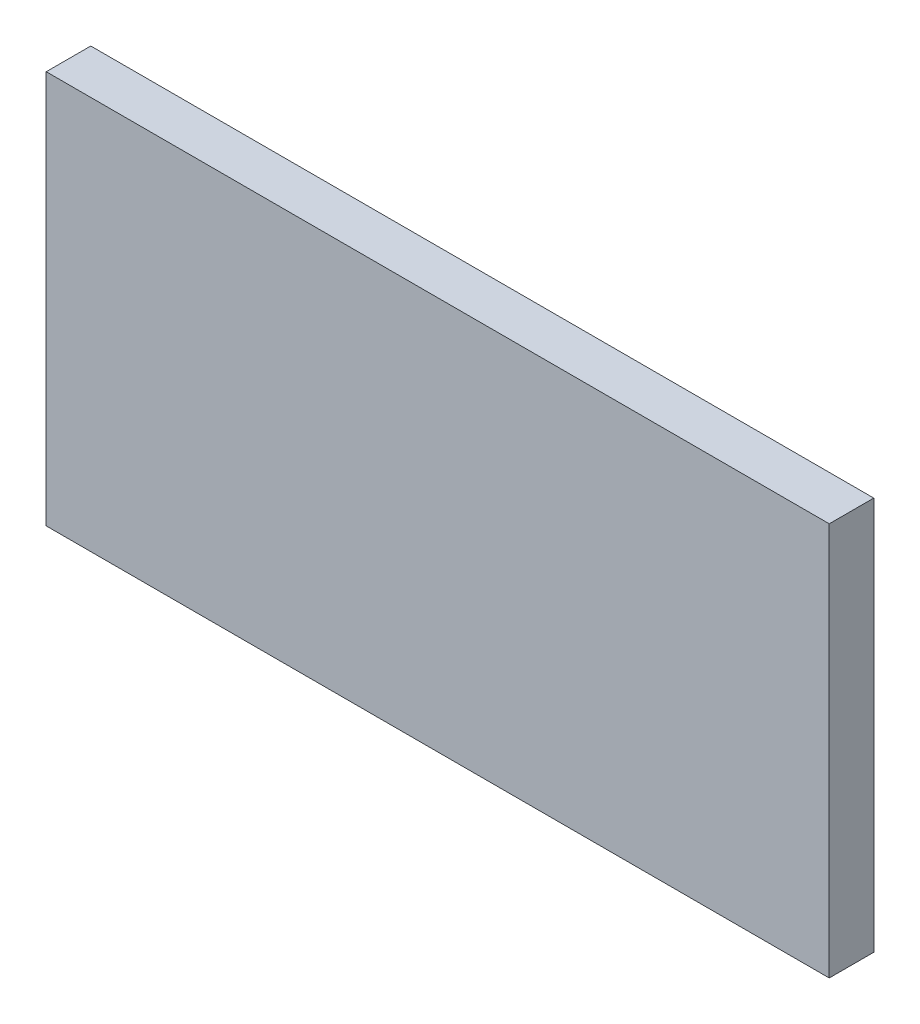
ISO-10303-21;
HEADER;
FILE_DESCRIPTION(('STEP AP214'),'2;1');
FILE_NAME('part.step','',(''),(''),'','','');
FILE_SCHEMA(('AUTOMOTIVE_DESIGN { 1 0 10303 214 1 1 1 1 }'));
ENDSEC;
DATA;
#1=APPLICATION_CONTEXT('core data for automotive mechanical design processes');
#2=APPLICATION_PROTOCOL_DEFINITION('international standard','automotive_design',2000,#1);
#3=PRODUCT_CONTEXT('',#1,'mechanical');
#4=PRODUCT('Part','Part','',(#3));
#5=PRODUCT_RELATED_PRODUCT_CATEGORY('part','',(#4));
#6=PRODUCT_DEFINITION_FORMATION('','',#4);
#7=PRODUCT_DEFINITION_CONTEXT('part definition',#1,'design');
#8=PRODUCT_DEFINITION('design','',#6,#7);
#9=PRODUCT_DEFINITION_SHAPE('','',#8);
#10=(LENGTH_UNIT() NAMED_UNIT(*) SI_UNIT(.MILLI.,.METRE.));
#11=(NAMED_UNIT(*) PLANE_ANGLE_UNIT() SI_UNIT($,.RADIAN.));
#12=(NAMED_UNIT(*) SI_UNIT($,.STERADIAN.) SOLID_ANGLE_UNIT());
#13=UNCERTAINTY_MEASURE_WITH_UNIT(LENGTH_MEASURE(1.E-05),#10,'distance_accuracy_value','');
#14=(GEOMETRIC_REPRESENTATION_CONTEXT(3) GLOBAL_UNCERTAINTY_ASSIGNED_CONTEXT((#13)) GLOBAL_UNIT_ASSIGNED_CONTEXT((#10,
#11,#12)) REPRESENTATION_CONTEXT('',''));
#15=CARTESIAN_POINT('',(0.,0.,0.));
#16=DIRECTION('',(0.,0.,1.));
#17=DIRECTION('',(1.,0.,0.));
#18=AXIS2_PLACEMENT_3D('',#15,#16,#17);
#19=CARTESIAN_POINT('',(-8.46798705037145,-113.306127467952,0.761999999999523));
#20=DIRECTION('',(1.00000000000006,0.,0.));
#21=DIRECTION('',(0.,0.999999999999991,0.));
#22=AXIS2_PLACEMENT_3D('',#19,#20,#21);
#23=PLANE('',#22);
#24=DIRECTION('',(0.,-0.999999999999991,0.));
#25=VECTOR('',#24,1.);
#26=CARTESIAN_POINT('',(-8.46798705037151,-113.306127467952,-4.3454823073219E-13));
#27=LINE('',#26,#25);
#28=CARTESIAN_POINT('',(-8.46798705037157,-106.575127467951,-2.41126563160776E-13));
#29=VERTEX_POINT('',#28);
#30=CARTESIAN_POINT('',(-8.46798705037151,-113.306127467952,-4.3454823073219E-13));
#31=VERTEX_POINT('',#30);
#32=EDGE_CURVE('E97',#29,#31,#27,.T.);
#33=ORIENTED_EDGE('',*,*,#32,.T.);
#34=DIRECTION('',(0.,0.,-1.00000000000005));
#35=VECTOR('',#34,1.);
#36=CARTESIAN_POINT('',(-8.46798705037145,-113.306127467952,0.761999999999523));
#37=LINE('',#36,#35);
#38=CARTESIAN_POINT('',(-8.46798705037145,-113.306127467952,0.761999999999523));
#39=VERTEX_POINT('',#38);
#40=EDGE_CURVE('E11',#39,#31,#37,.T.);
#41=ORIENTED_EDGE('',*,*,#40,.F.);
#42=DIRECTION('',(0.,-0.999999999999991,0.));
#43=VECTOR('',#42,1.);
#44=CARTESIAN_POINT('',(-8.46798705037145,-113.306127467952,0.761999999999523));
#45=LINE('',#44,#43);
#46=CARTESIAN_POINT('',(-8.46798705037149,-106.575127467951,0.761999999999799));
#47=VERTEX_POINT('',#46);
#48=EDGE_CURVE('E85',#47,#39,#45,.T.);
#49=ORIENTED_EDGE('',*,*,#48,.F.);
#50=DIRECTION('',(0.,0.,-1.00000000000005));
#51=VECTOR('',#50,1.);
#52=CARTESIAN_POINT('',(-8.46798705037149,-106.575127467951,0.761999999999799));
#53=LINE('',#52,#51);
#54=EDGE_CURVE('E93',#47,#29,#53,.T.);
#55=ORIENTED_EDGE('',*,*,#54,.T.);
#56=EDGE_LOOP('',(#33,#41,#49,#55));
#57=FACE_BOUND('',#56,.T.);
#58=ADVANCED_FACE('F34',(#57),#23,.F.);
#59=CARTESIAN_POINT('',(-8.46798705037145,-113.306127467952,0.761999999999523));
#60=DIRECTION('',(0.,0.99999999999999,0.));
#61=DIRECTION('',(-1.00000000000006,0.,0.));
#62=AXIS2_PLACEMENT_3D('',#59,#60,#61);
#63=PLANE('',#62);
#64=DIRECTION('',(1.00000000000006,0.,0.));
#65=VECTOR('',#64,1.);
#66=CARTESIAN_POINT('',(-8.46798705037151,-113.306127467952,-4.3454823073219E-13));
#67=LINE('',#66,#65);
#68=CARTESIAN_POINT('',(4.93051294962864,-113.306127467952,-3.76434994286967E-13));
#69=VERTEX_POINT('',#68);
#70=EDGE_CURVE('E89',#31,#69,#67,.T.);
#71=ORIENTED_EDGE('',*,*,#70,.T.);
#72=DIRECTION('',(0.,0.,-1.00000000000005));
#73=VECTOR('',#72,1.);
#74=CARTESIAN_POINT('',(4.93051294962857,-113.306127467952,0.761999999999773));
#75=LINE('',#74,#73);
#76=CARTESIAN_POINT('',(4.93051294962857,-113.306127467952,0.761999999999773));
#77=VERTEX_POINT('',#76);
#78=EDGE_CURVE('E42',#77,#69,#75,.T.);
#79=ORIENTED_EDGE('',*,*,#78,.F.);
#80=DIRECTION('',(1.00000000000006,0.,0.));
#81=VECTOR('',#80,1.);
#82=CARTESIAN_POINT('',(-8.46798705037145,-113.306127467952,0.761999999999523));
#83=LINE('',#82,#81);
#84=EDGE_CURVE('E80',#39,#77,#83,.T.);
#85=ORIENTED_EDGE('',*,*,#84,.F.);
#86=ORIENTED_EDGE('',*,*,#40,.T.);
#87=EDGE_LOOP('',(#71,#79,#85,#86));
#88=FACE_BOUND('',#87,.T.);
#89=ADVANCED_FACE('F88',(#88),#63,.F.);
#90=CARTESIAN_POINT('',(4.93051294962857,-113.306127467952,0.761999999999773));
#91=DIRECTION('',(-1.00000000000006,0.,0.));
#92=DIRECTION('',(0.,0.,1.00000000000005));
#93=AXIS2_PLACEMENT_3D('',#90,#91,#92);
#94=PLANE('',#93);
#95=DIRECTION('',(0.,0.999999999999993,0.));
#96=VECTOR('',#95,1.);
#97=CARTESIAN_POINT('',(4.93051294962864,-113.306127467952,-3.76434994286967E-13));
#98=LINE('',#97,#96);
#99=CARTESIAN_POINT('',(4.93051294962864,-106.575127467951,-2.16840434497101E-13));
#100=VERTEX_POINT('',#99);
#101=EDGE_CURVE('E67',#69,#100,#98,.T.);
#102=ORIENTED_EDGE('',*,*,#101,.T.);
#103=DIRECTION('',(0.,0.,-1.00000000000005));
#104=VECTOR('',#103,1.);
#105=CARTESIAN_POINT('',(4.93051294962865,-106.575127467951,0.761999999999713));
#106=LINE('',#105,#104);
#107=CARTESIAN_POINT('',(4.93051294962865,-106.575127467951,0.761999999999713));
#108=VERTEX_POINT('',#107);
#109=EDGE_CURVE('E90',#108,#100,#106,.T.);
#110=ORIENTED_EDGE('',*,*,#109,.F.);
#111=DIRECTION('',(0.,0.999999999999993,0.));
#112=VECTOR('',#111,1.);
#113=CARTESIAN_POINT('',(4.93051294962857,-113.306127467952,0.761999999999773));
#114=LINE('',#113,#112);
#115=EDGE_CURVE('E83',#77,#108,#114,.T.);
#116=ORIENTED_EDGE('',*,*,#115,.F.);
#117=ORIENTED_EDGE('',*,*,#78,.T.);
#118=EDGE_LOOP('',(#102,#110,#116,#117));
#119=FACE_BOUND('',#118,.T.);
#120=ADVANCED_FACE('F91',(#119),#94,.F.);
#121=CARTESIAN_POINT('',(-8.46798705037149,-106.575127467951,0.761999999999799));
#122=DIRECTION('',(0.,-0.99999999999999,0.));
#123=DIRECTION('',(1.00000000000006,0.,0.));
#124=AXIS2_PLACEMENT_3D('',#121,#122,#123);
#125=PLANE('',#124);
#126=DIRECTION('',(-1.00000000000006,0.,0.));
#127=VECTOR('',#126,1.);
#128=CARTESIAN_POINT('',(-8.46798705037157,-106.575127467951,-2.41126563160776E-13));
#129=LINE('',#128,#127);
#130=EDGE_CURVE('E73',#100,#29,#129,.T.);
#131=ORIENTED_EDGE('',*,*,#130,.T.);
#132=ORIENTED_EDGE('',*,*,#54,.F.);
#133=DIRECTION('',(-1.00000000000006,0.,0.));
#134=VECTOR('',#133,1.);
#135=CARTESIAN_POINT('',(-8.46798705037149,-106.575127467951,0.761999999999799));
#136=LINE('',#135,#134);
#137=EDGE_CURVE('E50',#108,#47,#136,.T.);
#138=ORIENTED_EDGE('',*,*,#137,.F.);
#139=ORIENTED_EDGE('',*,*,#109,.T.);
#140=EDGE_LOOP('',(#131,#132,#138,#139));
#141=FACE_BOUND('',#140,.T.);
#142=ADVANCED_FACE('F104',(#141),#125,.F.);
#143=CARTESIAN_POINT('',(-1.07552855510562E-13,0.,0.762000000000068));
#144=DIRECTION('',(0.,0.,-1.00000000000005));
#145=DIRECTION('',(-1.00000000000006,0.,0.));
#146=AXIS2_PLACEMENT_3D('',#143,#144,#145);
#147=PLANE('',#146);
#148=ORIENTED_EDGE('',*,*,#48,.T.);
#149=ORIENTED_EDGE('',*,*,#84,.T.);
#150=ORIENTED_EDGE('',*,*,#115,.T.);
#151=ORIENTED_EDGE('',*,*,#137,.T.);
#152=EDGE_LOOP('',(#148,#149,#150,#151));
#153=FACE_BOUND('',#152,.T.);
#154=ADVANCED_FACE('F81',(#153),#147,.F.);
#155=CARTESIAN_POINT('',(0.,0.,0.));
#156=DIRECTION('',(0.,0.,-1.00000000000005));
#157=DIRECTION('',(-1.00000000000006,0.,0.));
#158=AXIS2_PLACEMENT_3D('',#155,#156,#157);
#159=PLANE('',#158);
#160=ORIENTED_EDGE('',*,*,#32,.F.);
#161=ORIENTED_EDGE('',*,*,#130,.F.);
#162=ORIENTED_EDGE('',*,*,#101,.F.);
#163=ORIENTED_EDGE('',*,*,#70,.F.);
#164=EDGE_LOOP('',(#160,#161,#162,#163));
#165=FACE_BOUND('',#164,.T.);
#166=ADVANCED_FACE('F107',(#165),#159,.T.);
#167=CLOSED_SHELL('',(#58,#89,#120,#142,#154,#166));
#168=MANIFOLD_SOLID_BREP('B2',#167);
#169=ADVANCED_BREP_SHAPE_REPRESENTATION('',(#18,#168),#14);
#170=SHAPE_DEFINITION_REPRESENTATION(#9,#169);
ENDSEC;
END-ISO-10303-21;
